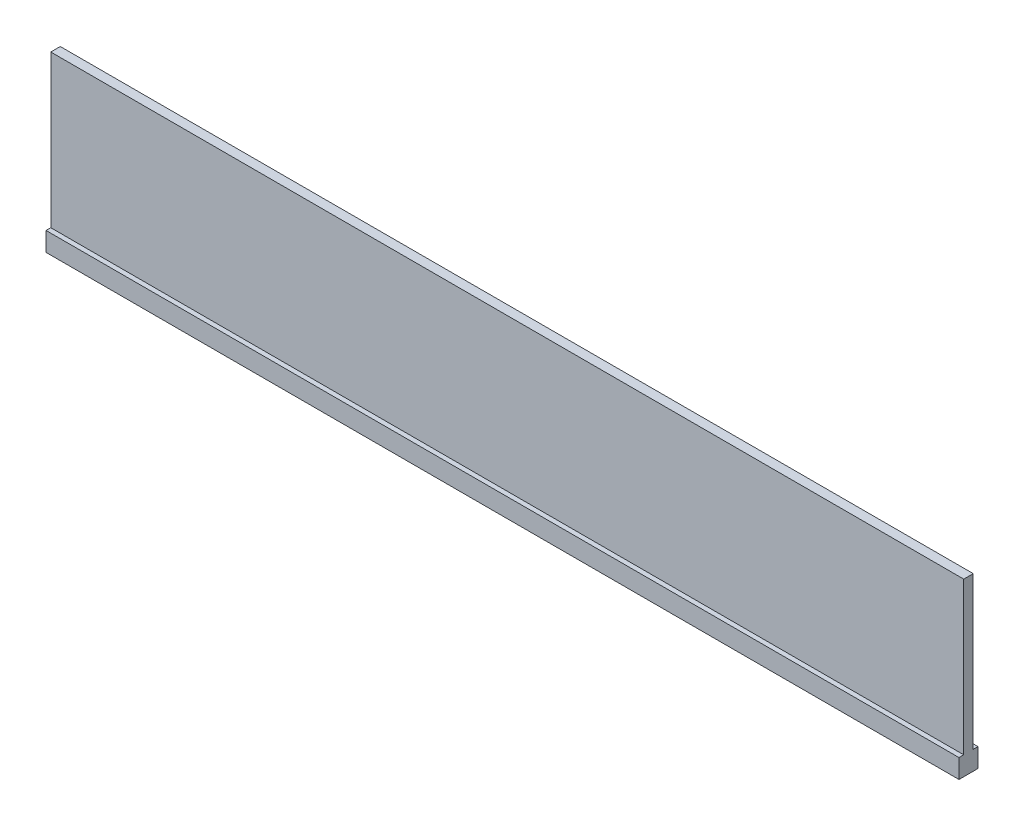
ISO-10303-21;
HEADER;
FILE_DESCRIPTION(('STEP AP214'),'2;1');
FILE_NAME('part.step','',(''),(''),'','','');
FILE_SCHEMA(('AUTOMOTIVE_DESIGN { 1 0 10303 214 1 1 1 1 }'));
ENDSEC;
DATA;
#1=APPLICATION_CONTEXT('core data for automotive mechanical design processes');
#2=APPLICATION_PROTOCOL_DEFINITION('international standard','automotive_design',2000,#1);
#3=PRODUCT_CONTEXT('',#1,'mechanical');
#4=PRODUCT('Part','Part','',(#3));
#5=PRODUCT_RELATED_PRODUCT_CATEGORY('part','',(#4));
#6=PRODUCT_DEFINITION_FORMATION('','',#4);
#7=PRODUCT_DEFINITION_CONTEXT('part definition',#1,'design');
#8=PRODUCT_DEFINITION('design','',#6,#7);
#9=PRODUCT_DEFINITION_SHAPE('','',#8);
#10=(LENGTH_UNIT() NAMED_UNIT(*) SI_UNIT(.MILLI.,.METRE.));
#11=(NAMED_UNIT(*) PLANE_ANGLE_UNIT() SI_UNIT($,.RADIAN.));
#12=(NAMED_UNIT(*) SI_UNIT($,.STERADIAN.) SOLID_ANGLE_UNIT());
#13=UNCERTAINTY_MEASURE_WITH_UNIT(LENGTH_MEASURE(1.E-05),#10,'distance_accuracy_value','');
#14=(GEOMETRIC_REPRESENTATION_CONTEXT(3) GLOBAL_UNCERTAINTY_ASSIGNED_CONTEXT((#13)) GLOBAL_UNIT_ASSIGNED_CONTEXT((#10,
#11,#12)) REPRESENTATION_CONTEXT('',''));
#15=CARTESIAN_POINT('',(0.,0.,0.));
#16=DIRECTION('',(0.,0.,1.));
#17=DIRECTION('',(1.,0.,0.));
#18=AXIS2_PLACEMENT_3D('',#15,#16,#17);
#19=CARTESIAN_POINT('',(-91.3738160528579,28.9978047832589,1.5875));
#20=DIRECTION('',(1.,0.,0.));
#21=DIRECTION('',(0.,1.,0.));
#22=AXIS2_PLACEMENT_3D('',#19,#20,#21);
#23=PLANE('',#22);
#24=DIRECTION('',(0.,-1.,0.));
#25=VECTOR('',#24,1.);
#26=CARTESIAN_POINT('',(-91.3738160528579,28.9978047832589,0.));
#27=LINE('',#26,#25);
#28=CARTESIAN_POINT('',(-91.3738160528579,54.3978047832589,0.));
#29=VERTEX_POINT('',#28);
#30=CARTESIAN_POINT('',(-91.3738160528579,28.9978047832589,0.));
#31=VERTEX_POINT('',#30);
#32=EDGE_CURVE('E104',#29,#31,#27,.T.);
#33=ORIENTED_EDGE('',*,*,#32,.T.);
#34=DIRECTION('',(0.,0.,-1.));
#35=VECTOR('',#34,1.);
#36=CARTESIAN_POINT('',(-91.3738160528579,28.9978047832589,-0.79375));
#37=LINE('',#36,#35);
#38=CARTESIAN_POINT('',(-91.3738160528579,28.9978047832589,-0.79375));
#39=VERTEX_POINT('',#38);
#40=EDGE_CURVE('E222',#31,#39,#37,.T.);
#41=ORIENTED_EDGE('',*,*,#40,.T.);
#42=DIRECTION('',(0.,-1.,0.));
#43=VECTOR('',#42,1.);
#44=CARTESIAN_POINT('',(-91.3738160528579,28.9978047832589,-0.79375));
#45=LINE('',#44,#43);
#46=CARTESIAN_POINT('',(-91.3738160528579,25.8228047832589,-0.793749999999999));
#47=VERTEX_POINT('',#46);
#48=EDGE_CURVE('E218',#39,#47,#45,.T.);
#49=ORIENTED_EDGE('',*,*,#48,.T.);
#50=DIRECTION('',(0.,0.,1.));
#51=VECTOR('',#50,1.);
#52=CARTESIAN_POINT('',(-91.3738160528579,25.8228047832589,-0.793749999999999));
#53=LINE('',#52,#51);
#54=CARTESIAN_POINT('',(-91.3738160528579,25.8228047832589,2.38125));
#55=VERTEX_POINT('',#54);
#56=EDGE_CURVE('E205',#47,#55,#53,.T.);
#57=ORIENTED_EDGE('',*,*,#56,.T.);
#58=DIRECTION('',(0.,1.,0.));
#59=VECTOR('',#58,1.);
#60=CARTESIAN_POINT('',(-91.3738160528579,28.9978047832589,2.38125));
#61=LINE('',#60,#59);
#62=CARTESIAN_POINT('',(-91.3738160528579,28.9978047832589,2.38125));
#63=VERTEX_POINT('',#62);
#64=EDGE_CURVE('E217',#55,#63,#61,.T.);
#65=ORIENTED_EDGE('',*,*,#64,.T.);
#66=CARTESIAN_POINT('',(-91.3738160528579,28.9978047832589,1.5875));
#67=VERTEX_POINT('',#66);
#68=EDGE_CURVE('E229',#63,#67,#37,.T.);
#69=ORIENTED_EDGE('',*,*,#68,.T.);
#70=DIRECTION('',(0.,-1.,0.));
#71=VECTOR('',#70,1.);
#72=CARTESIAN_POINT('',(-91.3738160528579,28.9978047832589,1.5875));
#73=LINE('',#72,#71);
#74=CARTESIAN_POINT('',(-91.3738160528579,54.3978047832589,1.5875));
#75=VERTEX_POINT('',#74);
#76=EDGE_CURVE('E97',#75,#67,#73,.T.);
#77=ORIENTED_EDGE('',*,*,#76,.F.);
#78=DIRECTION('',(0.,0.,-1.));
#79=VECTOR('',#78,1.);
#80=CARTESIAN_POINT('',(-91.3738160528579,54.3978047832589,1.5875));
#81=LINE('',#80,#79);
#82=EDGE_CURVE('E41',#75,#29,#81,.T.);
#83=ORIENTED_EDGE('',*,*,#82,.T.);
#84=EDGE_LOOP('',(#33,#41,#49,#57,#65,#69,#77,#83));
#85=FACE_BOUND('',#84,.T.);
#86=ADVANCED_FACE('F33',(#85),#23,.F.);
#87=CARTESIAN_POINT('',(61.0261839471421,28.9978047832589,1.5875));
#88=DIRECTION('',(-1.,0.,0.));
#89=DIRECTION('',(0.,0.,1.));
#90=AXIS2_PLACEMENT_3D('',#87,#88,#89);
#91=PLANE('',#90);
#92=DIRECTION('',(0.,1.,0.));
#93=VECTOR('',#92,1.);
#94=CARTESIAN_POINT('',(61.0261839471421,28.9978047832589,0.));
#95=LINE('',#94,#93);
#96=CARTESIAN_POINT('',(61.0261839471421,28.997804783259,0.));
#97=VERTEX_POINT('',#96);
#98=CARTESIAN_POINT('',(61.0261839471421,54.3978047832589,0.));
#99=VERTEX_POINT('',#98);
#100=EDGE_CURVE('E61',#97,#99,#95,.T.);
#101=ORIENTED_EDGE('',*,*,#100,.T.);
#102=DIRECTION('',(0.,0.,-1.));
#103=VECTOR('',#102,1.);
#104=CARTESIAN_POINT('',(61.0261839471421,54.3978047832589,1.5875));
#105=LINE('',#104,#103);
#106=CARTESIAN_POINT('',(61.0261839471421,54.3978047832589,1.5875));
#107=VERTEX_POINT('',#106);
#108=EDGE_CURVE('E11',#107,#99,#105,.T.);
#109=ORIENTED_EDGE('',*,*,#108,.F.);
#110=DIRECTION('',(0.,1.,0.));
#111=VECTOR('',#110,1.);
#112=CARTESIAN_POINT('',(61.0261839471421,28.9978047832589,1.5875));
#113=LINE('',#112,#111);
#114=CARTESIAN_POINT('',(61.0261839471421,28.9978047832589,1.5875));
#115=VERTEX_POINT('',#114);
#116=EDGE_CURVE('E95',#115,#107,#113,.T.);
#117=ORIENTED_EDGE('',*,*,#116,.F.);
#118=DIRECTION('',(0.,0.,-1.));
#119=VECTOR('',#118,1.);
#120=CARTESIAN_POINT('',(61.0261839471421,28.997804783259,-0.79375));
#121=LINE('',#120,#119);
#122=CARTESIAN_POINT('',(61.0261839471421,28.997804783259,2.38125));
#123=VERTEX_POINT('',#122);
#124=EDGE_CURVE('E79',#123,#115,#121,.T.);
#125=ORIENTED_EDGE('',*,*,#124,.F.);
#126=DIRECTION('',(0.,1.,0.));
#127=VECTOR('',#126,1.);
#128=CARTESIAN_POINT('',(61.0261839471421,28.997804783259,2.38125));
#129=LINE('',#128,#127);
#130=CARTESIAN_POINT('',(61.0261839471421,25.822804783259,2.38125));
#131=VERTEX_POINT('',#130);
#132=EDGE_CURVE('E242',#131,#123,#129,.T.);
#133=ORIENTED_EDGE('',*,*,#132,.F.);
#134=DIRECTION('',(0.,0.,1.));
#135=VECTOR('',#134,1.);
#136=CARTESIAN_POINT('',(61.0261839471421,25.822804783259,-0.793749999999999));
#137=LINE('',#136,#135);
#138=CARTESIAN_POINT('',(61.0261839471421,25.822804783259,-0.793749999999999));
#139=VERTEX_POINT('',#138);
#140=EDGE_CURVE('E240',#139,#131,#137,.T.);
#141=ORIENTED_EDGE('',*,*,#140,.F.);
#142=DIRECTION('',(0.,-1.,0.));
#143=VECTOR('',#142,1.);
#144=CARTESIAN_POINT('',(61.0261839471421,28.997804783259,-0.79375));
#145=LINE('',#144,#143);
#146=CARTESIAN_POINT('',(61.0261839471421,28.997804783259,-0.79375));
#147=VERTEX_POINT('',#146);
#148=EDGE_CURVE('E231',#147,#139,#145,.T.);
#149=ORIENTED_EDGE('',*,*,#148,.F.);
#150=EDGE_CURVE('E92',#97,#147,#121,.T.);
#151=ORIENTED_EDGE('',*,*,#150,.F.);
#152=EDGE_LOOP('',(#101,#109,#117,#125,#133,#141,#149,#151));
#153=FACE_BOUND('',#152,.T.);
#154=ADVANCED_FACE('F99',(#153),#91,.F.);
#155=CARTESIAN_POINT('',(-91.3738160528579,54.3978047832589,1.5875));
#156=DIRECTION('',(0.,-1.,0.));
#157=DIRECTION('',(0.,0.,-1.));
#158=AXIS2_PLACEMENT_3D('',#155,#156,#157);
#159=PLANE('',#158);
#160=DIRECTION('',(-1.,0.,0.));
#161=VECTOR('',#160,1.);
#162=CARTESIAN_POINT('',(-91.3738160528579,54.3978047832589,0.));
#163=LINE('',#162,#161);
#164=EDGE_CURVE('E110',#99,#29,#163,.T.);
#165=ORIENTED_EDGE('',*,*,#164,.T.);
#166=ORIENTED_EDGE('',*,*,#82,.F.);
#167=DIRECTION('',(-1.,0.,0.));
#168=VECTOR('',#167,1.);
#169=CARTESIAN_POINT('',(-91.3738160528579,54.3978047832589,1.5875));
#170=LINE('',#169,#168);
#171=EDGE_CURVE('E49',#107,#75,#170,.T.);
#172=ORIENTED_EDGE('',*,*,#171,.F.);
#173=ORIENTED_EDGE('',*,*,#108,.T.);
#174=EDGE_LOOP('',(#165,#166,#172,#173));
#175=FACE_BOUND('',#174,.T.);
#176=ADVANCED_FACE('F119',(#175),#159,.F.);
#177=CARTESIAN_POINT('',(0.,0.,1.5875));
#178=DIRECTION('',(0.,0.,-1.));
#179=DIRECTION('',(-1.,0.,0.));
#180=AXIS2_PLACEMENT_3D('',#177,#178,#179);
#181=PLANE('',#180);
#182=ORIENTED_EDGE('',*,*,#76,.T.);
#183=DIRECTION('',(1.,0.,0.));
#184=VECTOR('',#183,1.);
#185=CARTESIAN_POINT('',(-91.3738160528579,28.9978047832589,1.5875));
#186=LINE('',#185,#184);
#187=EDGE_CURVE('E83',#67,#115,#186,.T.);
#188=ORIENTED_EDGE('',*,*,#187,.T.);
#189=ORIENTED_EDGE('',*,*,#116,.T.);
#190=ORIENTED_EDGE('',*,*,#171,.T.);
#191=EDGE_LOOP('',(#182,#188,#189,#190));
#192=FACE_BOUND('',#191,.T.);
#193=ADVANCED_FACE('F94',(#192),#181,.F.);
#194=CARTESIAN_POINT('',(0.,0.,0.));
#195=DIRECTION('',(0.,0.,-1.));
#196=DIRECTION('',(-1.,0.,0.));
#197=AXIS2_PLACEMENT_3D('',#194,#195,#196);
#198=PLANE('',#197);
#199=ORIENTED_EDGE('',*,*,#32,.F.);
#200=ORIENTED_EDGE('',*,*,#164,.F.);
#201=ORIENTED_EDGE('',*,*,#100,.F.);
#202=DIRECTION('',(1.,0.,0.));
#203=VECTOR('',#202,1.);
#204=CARTESIAN_POINT('',(-91.3738160528579,28.9978047832589,0.));
#205=LINE('',#204,#203);
#206=EDGE_CURVE('E70',#31,#97,#205,.T.);
#207=ORIENTED_EDGE('',*,*,#206,.F.);
#208=EDGE_LOOP('',(#199,#200,#201,#207));
#209=FACE_BOUND('',#208,.T.);
#210=ADVANCED_FACE('F118',(#209),#198,.T.);
#211=CARTESIAN_POINT('',(61.0261839471421,28.997804783259,-0.79375));
#212=DIRECTION('',(0.,1.,0.));
#213=DIRECTION('',(-1.,0.,0.));
#214=AXIS2_PLACEMENT_3D('',#211,#212,#213);
#215=PLANE('',#214);
#216=ORIENTED_EDGE('',*,*,#187,.F.);
#217=ORIENTED_EDGE('',*,*,#68,.F.);
#218=DIRECTION('',(-1.,0.,0.));
#219=VECTOR('',#218,1.);
#220=CARTESIAN_POINT('',(61.0261839471421,28.997804783259,2.38125));
#221=LINE('',#220,#219);
#222=EDGE_CURVE('E87',#123,#63,#221,.T.);
#223=ORIENTED_EDGE('',*,*,#222,.F.);
#224=ORIENTED_EDGE('',*,*,#124,.T.);
#225=EDGE_LOOP('',(#216,#217,#223,#224));
#226=FACE_BOUND('',#225,.T.);
#227=ADVANCED_FACE('F81',(#226),#215,.T.);
#228=CARTESIAN_POINT('',(61.0261839471421,28.997804783259,-0.79375));
#229=DIRECTION('',(0.,0.,-1.));
#230=DIRECTION('',(0.,1.,0.));
#231=AXIS2_PLACEMENT_3D('',#228,#229,#230);
#232=PLANE('',#231);
#233=ORIENTED_EDGE('',*,*,#48,.F.);
#234=DIRECTION('',(-1.,0.,0.));
#235=VECTOR('',#234,1.);
#236=CARTESIAN_POINT('',(61.0261839471421,28.997804783259,-0.79375));
#237=LINE('',#236,#235);
#238=EDGE_CURVE('E107',#147,#39,#237,.T.);
#239=ORIENTED_EDGE('',*,*,#238,.F.);
#240=ORIENTED_EDGE('',*,*,#148,.T.);
#241=DIRECTION('',(-1.,0.,0.));
#242=VECTOR('',#241,1.);
#243=CARTESIAN_POINT('',(61.0261839471421,25.822804783259,-0.793749999999999));
#244=LINE('',#243,#242);
#245=EDGE_CURVE('E91',#139,#47,#244,.T.);
#246=ORIENTED_EDGE('',*,*,#245,.T.);
#247=EDGE_LOOP('',(#233,#239,#240,#246));
#248=FACE_BOUND('',#247,.T.);
#249=ADVANCED_FACE('F159',(#248),#232,.T.);
#250=ORIENTED_EDGE('',*,*,#40,.F.);
#251=ORIENTED_EDGE('',*,*,#206,.T.);
#252=ORIENTED_EDGE('',*,*,#150,.T.);
#253=ORIENTED_EDGE('',*,*,#238,.T.);
#254=EDGE_LOOP('',(#250,#251,#252,#253));
#255=FACE_BOUND('',#254,.T.);
#256=ADVANCED_FACE('F161',(#255),#215,.T.);
#257=CARTESIAN_POINT('',(61.0261839471421,28.997804783259,2.38125));
#258=DIRECTION('',(0.,0.,1.));
#259=DIRECTION('',(0.,-1.,0.));
#260=AXIS2_PLACEMENT_3D('',#257,#258,#259);
#261=PLANE('',#260);
#262=ORIENTED_EDGE('',*,*,#64,.F.);
#263=DIRECTION('',(-1.,0.,0.));
#264=VECTOR('',#263,1.);
#265=CARTESIAN_POINT('',(61.0261839471421,25.822804783259,2.38125));
#266=LINE('',#265,#264);
#267=EDGE_CURVE('E213',#131,#55,#266,.T.);
#268=ORIENTED_EDGE('',*,*,#267,.F.);
#269=ORIENTED_EDGE('',*,*,#132,.T.);
#270=ORIENTED_EDGE('',*,*,#222,.T.);
#271=EDGE_LOOP('',(#262,#268,#269,#270));
#272=FACE_BOUND('',#271,.T.);
#273=ADVANCED_FACE('F178',(#272),#261,.T.);
#274=CARTESIAN_POINT('',(61.0261839471421,25.822804783259,-0.793749999999999));
#275=DIRECTION('',(0.,-1.,0.));
#276=DIRECTION('',(1.,0.,0.));
#277=AXIS2_PLACEMENT_3D('',#274,#275,#276);
#278=PLANE('',#277);
#279=ORIENTED_EDGE('',*,*,#56,.F.);
#280=ORIENTED_EDGE('',*,*,#245,.F.);
#281=ORIENTED_EDGE('',*,*,#140,.T.);
#282=ORIENTED_EDGE('',*,*,#267,.T.);
#283=EDGE_LOOP('',(#279,#280,#281,#282));
#284=FACE_BOUND('',#283,.T.);
#285=ADVANCED_FACE('F186',(#284),#278,.T.);
#286=CLOSED_SHELL('',(#86,#154,#176,#193,#210,#227,#249,#256,#273,#285));
#287=MANIFOLD_SOLID_BREP('B2',#286);
#288=ADVANCED_BREP_SHAPE_REPRESENTATION('',(#18,#287),#14);
#289=SHAPE_DEFINITION_REPRESENTATION(#9,#288);
ENDSEC;
END-ISO-10303-21;
